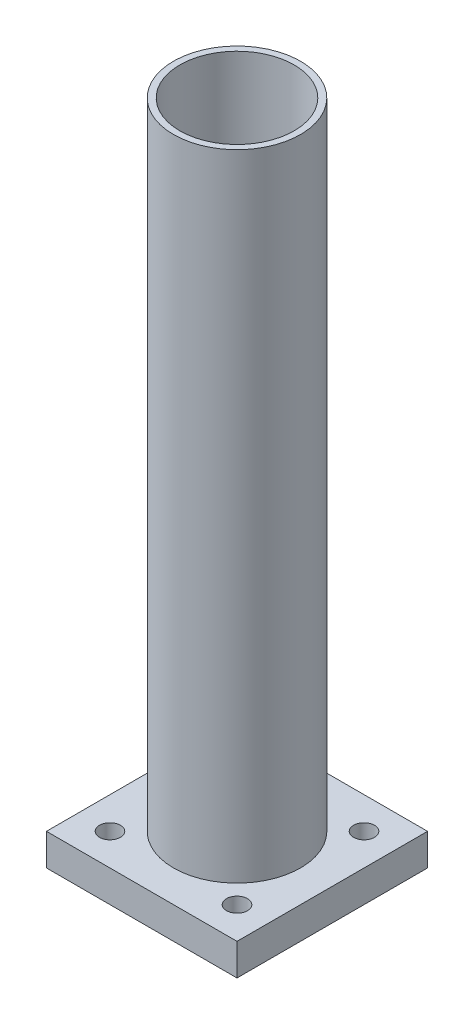
ISO-10303-21;
HEADER;
FILE_DESCRIPTION(('STEP AP214'),'2;1');
FILE_NAME('part.step','',(''),(''),'','','');
FILE_SCHEMA(('AUTOMOTIVE_DESIGN { 1 0 10303 214 1 1 1 1 }'));
ENDSEC;
DATA;
#1=APPLICATION_CONTEXT('core data for automotive mechanical design processes');
#2=APPLICATION_PROTOCOL_DEFINITION('international standard','automotive_design',2000,#1);
#3=PRODUCT_CONTEXT('',#1,'mechanical');
#4=PRODUCT('Part','Part','',(#3));
#5=PRODUCT_RELATED_PRODUCT_CATEGORY('part','',(#4));
#6=PRODUCT_DEFINITION_FORMATION('','',#4);
#7=PRODUCT_DEFINITION_CONTEXT('part definition',#1,'design');
#8=PRODUCT_DEFINITION('design','',#6,#7);
#9=PRODUCT_DEFINITION_SHAPE('','',#8);
#10=(LENGTH_UNIT() NAMED_UNIT(*) SI_UNIT(.MILLI.,.METRE.));
#11=(NAMED_UNIT(*) PLANE_ANGLE_UNIT() SI_UNIT($,.RADIAN.));
#12=(NAMED_UNIT(*) SI_UNIT($,.STERADIAN.) SOLID_ANGLE_UNIT());
#13=UNCERTAINTY_MEASURE_WITH_UNIT(LENGTH_MEASURE(1.E-05),#10,'distance_accuracy_value','');
#14=(GEOMETRIC_REPRESENTATION_CONTEXT(3) GLOBAL_UNCERTAINTY_ASSIGNED_CONTEXT((#13)) GLOBAL_UNIT_ASSIGNED_CONTEXT((#10,
#11,#12)) REPRESENTATION_CONTEXT('',''));
#15=CARTESIAN_POINT('',(0.,0.,0.));
#16=DIRECTION('',(0.,0.,1.));
#17=DIRECTION('',(1.,0.,0.));
#18=AXIS2_PLACEMENT_3D('',#15,#16,#17);
#19=CARTESIAN_POINT('',(-30.,-10.,30.));
#20=DIRECTION('',(-1.,0.,0.));
#21=DIRECTION('',(0.,0.,1.));
#22=AXIS2_PLACEMENT_3D('',#19,#20,#21);
#23=PLANE('',#22);
#24=DIRECTION('',(0.,0.,1.));
#25=VECTOR('',#24,1.);
#26=CARTESIAN_POINT('',(-30.,0.,30.));
#27=LINE('',#26,#25);
#28=CARTESIAN_POINT('',(-30.,0.,-30.));
#29=VERTEX_POINT('',#28);
#30=CARTESIAN_POINT('',(-30.,0.,30.));
#31=VERTEX_POINT('',#30);
#32=EDGE_CURVE('E108',#29,#31,#27,.T.);
#33=ORIENTED_EDGE('',*,*,#32,.F.);
#34=DIRECTION('',(0.,1.,0.));
#35=VECTOR('',#34,1.);
#36=CARTESIAN_POINT('',(-30.,-10.,-30.));
#37=LINE('',#36,#35);
#38=CARTESIAN_POINT('',(-30.,-10.,-30.));
#39=VERTEX_POINT('',#38);
#40=EDGE_CURVE('E12',#39,#29,#37,.T.);
#41=ORIENTED_EDGE('',*,*,#40,.F.);
#42=DIRECTION('',(0.,0.,1.));
#43=VECTOR('',#42,1.);
#44=CARTESIAN_POINT('',(-30.,-10.,30.));
#45=LINE('',#44,#43);
#46=CARTESIAN_POINT('',(-30.,-10.,30.));
#47=VERTEX_POINT('',#46);
#48=EDGE_CURVE('E101',#39,#47,#45,.T.);
#49=ORIENTED_EDGE('',*,*,#48,.T.);
#50=DIRECTION('',(0.,1.,0.));
#51=VECTOR('',#50,1.);
#52=CARTESIAN_POINT('',(-30.,-10.,30.));
#53=LINE('',#52,#51);
#54=EDGE_CURVE('E46',#47,#31,#53,.T.);
#55=ORIENTED_EDGE('',*,*,#54,.T.);
#56=EDGE_LOOP('',(#33,#41,#49,#55));
#57=FACE_BOUND('',#56,.T.);
#58=ADVANCED_FACE('F43',(#57),#23,.T.);
#59=CARTESIAN_POINT('',(30.,-10.,-30.));
#60=DIRECTION('',(0.,0.,-1.));
#61=DIRECTION('',(-1.,0.,0.));
#62=AXIS2_PLACEMENT_3D('',#59,#60,#61);
#63=PLANE('',#62);
#64=DIRECTION('',(-1.,0.,0.));
#65=VECTOR('',#64,1.);
#66=CARTESIAN_POINT('',(30.,0.,-30.));
#67=LINE('',#66,#65);
#68=CARTESIAN_POINT('',(30.,0.,-30.));
#69=VERTEX_POINT('',#68);
#70=EDGE_CURVE('E103',#69,#29,#67,.T.);
#71=ORIENTED_EDGE('',*,*,#70,.F.);
#72=DIRECTION('',(0.,1.,0.));
#73=VECTOR('',#72,1.);
#74=CARTESIAN_POINT('',(30.,-10.,-30.));
#75=LINE('',#74,#73);
#76=CARTESIAN_POINT('',(30.,-10.,-30.));
#77=VERTEX_POINT('',#76);
#78=EDGE_CURVE('E52',#77,#69,#75,.T.);
#79=ORIENTED_EDGE('',*,*,#78,.F.);
#80=DIRECTION('',(-1.,0.,0.));
#81=VECTOR('',#80,1.);
#82=CARTESIAN_POINT('',(30.,-10.,-30.));
#83=LINE('',#82,#81);
#84=EDGE_CURVE('E98',#77,#39,#83,.T.);
#85=ORIENTED_EDGE('',*,*,#84,.T.);
#86=ORIENTED_EDGE('',*,*,#40,.T.);
#87=EDGE_LOOP('',(#71,#79,#85,#86));
#88=FACE_BOUND('',#87,.T.);
#89=ADVANCED_FACE('F119',(#88),#63,.T.);
#90=CARTESIAN_POINT('',(30.,-10.,30.));
#91=DIRECTION('',(1.,0.,0.));
#92=DIRECTION('',(0.,0.,-1.));
#93=AXIS2_PLACEMENT_3D('',#90,#91,#92);
#94=PLANE('',#93);
#95=DIRECTION('',(0.,0.,-1.));
#96=VECTOR('',#95,1.);
#97=CARTESIAN_POINT('',(30.,0.,30.));
#98=LINE('',#97,#96);
#99=CARTESIAN_POINT('',(30.,0.,30.));
#100=VERTEX_POINT('',#99);
#101=EDGE_CURVE('E93',#100,#69,#98,.T.);
#102=ORIENTED_EDGE('',*,*,#101,.F.);
#103=DIRECTION('',(0.,1.,0.));
#104=VECTOR('',#103,1.);
#105=CARTESIAN_POINT('',(30.,-10.,30.));
#106=LINE('',#105,#104);
#107=CARTESIAN_POINT('',(30.,-10.,30.));
#108=VERTEX_POINT('',#107);
#109=EDGE_CURVE('E88',#108,#100,#106,.T.);
#110=ORIENTED_EDGE('',*,*,#109,.F.);
#111=DIRECTION('',(0.,0.,-1.));
#112=VECTOR('',#111,1.);
#113=CARTESIAN_POINT('',(30.,-10.,30.));
#114=LINE('',#113,#112);
#115=EDGE_CURVE('E91',#108,#77,#114,.T.);
#116=ORIENTED_EDGE('',*,*,#115,.T.);
#117=ORIENTED_EDGE('',*,*,#78,.T.);
#118=EDGE_LOOP('',(#102,#110,#116,#117));
#119=FACE_BOUND('',#118,.T.);
#120=ADVANCED_FACE('F90',(#119),#94,.T.);
#121=CARTESIAN_POINT('',(30.,-10.,30.));
#122=DIRECTION('',(0.,0.,1.));
#123=DIRECTION('',(1.,0.,0.));
#124=AXIS2_PLACEMENT_3D('',#121,#122,#123);
#125=PLANE('',#124);
#126=DIRECTION('',(1.,0.,0.));
#127=VECTOR('',#126,1.);
#128=CARTESIAN_POINT('',(30.,0.,30.));
#129=LINE('',#128,#127);
#130=EDGE_CURVE('E111',#31,#100,#129,.T.);
#131=ORIENTED_EDGE('',*,*,#130,.F.);
#132=ORIENTED_EDGE('',*,*,#54,.F.);
#133=DIRECTION('',(1.,0.,0.));
#134=VECTOR('',#133,1.);
#135=CARTESIAN_POINT('',(30.,-10.,30.));
#136=LINE('',#135,#134);
#137=EDGE_CURVE('E97',#47,#108,#136,.T.);
#138=ORIENTED_EDGE('',*,*,#137,.T.);
#139=ORIENTED_EDGE('',*,*,#109,.T.);
#140=EDGE_LOOP('',(#131,#132,#138,#139));
#141=FACE_BOUND('',#140,.T.);
#142=ADVANCED_FACE('F100',(#141),#125,.T.);
#143=CARTESIAN_POINT('',(0.,-10.,0.));
#144=DIRECTION('',(0.,1.,0.));
#145=DIRECTION('',(0.,0.,1.));
#146=AXIS2_PLACEMENT_3D('',#143,#144,#145);
#147=PLANE('',#146);
#148=CARTESIAN_POINT('',(20.,-9.99999999999999,-20.));
#149=DIRECTION('',(0.,1.,0.));
#150=DIRECTION('',(0.,0.,1.));
#151=AXIS2_PLACEMENT_3D('',#148,#149,#150);
#152=CIRCLE('',#151,3.29999999999999);
#153=CARTESIAN_POINT('',(20.,-9.99999999999999,-16.7));
#154=VERTEX_POINT('',#153);
#155=EDGE_CURVE('E160',#154,#154,#152,.T.);
#156=ORIENTED_EDGE('',*,*,#155,.T.);
#157=EDGE_LOOP('',(#156));
#158=FACE_BOUND('',#157,.T.);
#159=CARTESIAN_POINT('',(-20.,-9.99999999999999,-20.));
#160=DIRECTION('',(0.,1.,0.));
#161=DIRECTION('',(0.,0.,1.));
#162=AXIS2_PLACEMENT_3D('',#159,#160,#161);
#163=CIRCLE('',#162,3.29999999999999);
#164=CARTESIAN_POINT('',(-20.,-9.99999999999999,-16.7));
#165=VERTEX_POINT('',#164);
#166=EDGE_CURVE('E170',#165,#165,#163,.T.);
#167=ORIENTED_EDGE('',*,*,#166,.T.);
#168=EDGE_LOOP('',(#167));
#169=FACE_BOUND('',#168,.T.);
#170=CARTESIAN_POINT('',(-20.,-9.99999999999999,20.));
#171=DIRECTION('',(0.,1.,0.));
#172=DIRECTION('',(0.,0.,1.));
#173=AXIS2_PLACEMENT_3D('',#170,#171,#172);
#174=CIRCLE('',#173,3.29999999999999);
#175=CARTESIAN_POINT('',(-20.,-9.99999999999999,23.3));
#176=VERTEX_POINT('',#175);
#177=EDGE_CURVE('E176',#176,#176,#174,.T.);
#178=ORIENTED_EDGE('',*,*,#177,.T.);
#179=EDGE_LOOP('',(#178));
#180=FACE_BOUND('',#179,.T.);
#181=CARTESIAN_POINT('',(20.,-9.99999999999999,20.));
#182=DIRECTION('',(0.,1.,0.));
#183=DIRECTION('',(0.,0.,1.));
#184=AXIS2_PLACEMENT_3D('',#181,#182,#183);
#185=CIRCLE('',#184,3.29999999999999);
#186=CARTESIAN_POINT('',(20.,-9.99999999999999,23.3));
#187=VERTEX_POINT('',#186);
#188=EDGE_CURVE('E112',#187,#187,#185,.T.);
#189=ORIENTED_EDGE('',*,*,#188,.T.);
#190=EDGE_LOOP('',(#189));
#191=FACE_BOUND('',#190,.T.);
#192=ORIENTED_EDGE('',*,*,#48,.F.);
#193=ORIENTED_EDGE('',*,*,#84,.F.);
#194=ORIENTED_EDGE('',*,*,#115,.F.);
#195=ORIENTED_EDGE('',*,*,#137,.F.);
#196=EDGE_LOOP('',(#192,#193,#194,#195));
#197=FACE_BOUND('',#196,.T.);
#198=ADVANCED_FACE('F96',(#158,#169,#180,#191,#197),#147,.F.);
#199=CARTESIAN_POINT('',(0.,0.,0.));
#200=DIRECTION('',(0.,1.,0.));
#201=DIRECTION('',(0.,0.,1.));
#202=AXIS2_PLACEMENT_3D('',#199,#200,#201);
#203=PLANE('',#202);
#204=CARTESIAN_POINT('',(20.,0.,-20.));
#205=DIRECTION('',(0.,1.,0.));
#206=DIRECTION('',(0.,0.,1.));
#207=AXIS2_PLACEMENT_3D('',#204,#205,#206);
#208=CIRCLE('',#207,3.29999999999999);
#209=CARTESIAN_POINT('',(20.,0.,-16.7));
#210=VERTEX_POINT('',#209);
#211=EDGE_CURVE('E163',#210,#210,#208,.T.);
#212=ORIENTED_EDGE('',*,*,#211,.F.);
#213=EDGE_LOOP('',(#212));
#214=FACE_BOUND('',#213,.T.);
#215=CARTESIAN_POINT('',(-20.,0.,-20.));
#216=DIRECTION('',(0.,1.,0.));
#217=DIRECTION('',(0.,0.,1.));
#218=AXIS2_PLACEMENT_3D('',#215,#216,#217);
#219=CIRCLE('',#218,3.29999999999999);
#220=CARTESIAN_POINT('',(-20.,0.,-16.7));
#221=VERTEX_POINT('',#220);
#222=EDGE_CURVE('E165',#221,#221,#219,.T.);
#223=ORIENTED_EDGE('',*,*,#222,.F.);
#224=EDGE_LOOP('',(#223));
#225=FACE_BOUND('',#224,.T.);
#226=CARTESIAN_POINT('',(-20.,0.,20.));
#227=DIRECTION('',(0.,1.,0.));
#228=DIRECTION('',(0.,0.,1.));
#229=AXIS2_PLACEMENT_3D('',#226,#227,#228);
#230=CIRCLE('',#229,3.29999999999999);
#231=CARTESIAN_POINT('',(-20.,0.,23.3));
#232=VERTEX_POINT('',#231);
#233=EDGE_CURVE('E173',#232,#232,#230,.T.);
#234=ORIENTED_EDGE('',*,*,#233,.F.);
#235=EDGE_LOOP('',(#234));
#236=FACE_BOUND('',#235,.T.);
#237=CARTESIAN_POINT('',(20.,0.,20.));
#238=DIRECTION('',(0.,1.,0.));
#239=DIRECTION('',(0.,0.,1.));
#240=AXIS2_PLACEMENT_3D('',#237,#238,#239);
#241=CIRCLE('',#240,3.29999999999999);
#242=CARTESIAN_POINT('',(20.,0.,23.3));
#243=VERTEX_POINT('',#242);
#244=EDGE_CURVE('E179',#243,#243,#241,.T.);
#245=ORIENTED_EDGE('',*,*,#244,.F.);
#246=EDGE_LOOP('',(#245));
#247=FACE_BOUND('',#246,.T.);
#248=ORIENTED_EDGE('',*,*,#32,.T.);
#249=ORIENTED_EDGE('',*,*,#130,.T.);
#250=ORIENTED_EDGE('',*,*,#101,.T.);
#251=ORIENTED_EDGE('',*,*,#70,.T.);
#252=EDGE_LOOP('',(#248,#249,#250,#251));
#253=FACE_BOUND('',#252,.T.);
#254=ADVANCED_FACE('F118',(#214,#225,#236,#247,#253),#203,.T.);
#255=CARTESIAN_POINT('',(20.,0.,20.));
#256=DIRECTION('',(0.,1.,0.));
#257=DIRECTION('',(0.,0.,1.));
#258=AXIS2_PLACEMENT_3D('',#255,#256,#257);
#259=CYLINDRICAL_SURFACE('',#258,3.29999999999999);
#260=ORIENTED_EDGE('',*,*,#188,.F.);
#261=EDGE_LOOP('',(#260));
#262=FACE_BOUND('',#261,.T.);
#263=ORIENTED_EDGE('',*,*,#244,.T.);
#264=EDGE_LOOP('',(#263));
#265=FACE_BOUND('',#264,.T.);
#266=ADVANCED_FACE('F137',(#262,#265),#259,.F.);
#267=CARTESIAN_POINT('',(-20.,0.,20.));
#268=DIRECTION('',(0.,1.,0.));
#269=DIRECTION('',(0.,0.,1.));
#270=AXIS2_PLACEMENT_3D('',#267,#268,#269);
#271=CYLINDRICAL_SURFACE('',#270,3.29999999999999);
#272=ORIENTED_EDGE('',*,*,#177,.F.);
#273=EDGE_LOOP('',(#272));
#274=FACE_BOUND('',#273,.T.);
#275=ORIENTED_EDGE('',*,*,#233,.T.);
#276=EDGE_LOOP('',(#275));
#277=FACE_BOUND('',#276,.T.);
#278=ADVANCED_FACE('F144',(#274,#277),#271,.F.);
#279=CARTESIAN_POINT('',(-20.,0.,-20.));
#280=DIRECTION('',(0.,1.,0.));
#281=DIRECTION('',(0.,0.,1.));
#282=AXIS2_PLACEMENT_3D('',#279,#280,#281);
#283=CYLINDRICAL_SURFACE('',#282,3.29999999999999);
#284=ORIENTED_EDGE('',*,*,#166,.F.);
#285=EDGE_LOOP('',(#284));
#286=FACE_BOUND('',#285,.T.);
#287=ORIENTED_EDGE('',*,*,#222,.T.);
#288=EDGE_LOOP('',(#287));
#289=FACE_BOUND('',#288,.T.);
#290=ADVANCED_FACE('F148',(#286,#289),#283,.F.);
#291=CARTESIAN_POINT('',(20.,0.,-20.));
#292=DIRECTION('',(0.,1.,0.));
#293=DIRECTION('',(0.,0.,1.));
#294=AXIS2_PLACEMENT_3D('',#291,#292,#293);
#295=CYLINDRICAL_SURFACE('',#294,3.29999999999999);
#296=ORIENTED_EDGE('',*,*,#155,.F.);
#297=EDGE_LOOP('',(#296));
#298=FACE_BOUND('',#297,.T.);
#299=ORIENTED_EDGE('',*,*,#211,.T.);
#300=EDGE_LOOP('',(#299));
#301=FACE_BOUND('',#300,.T.);
#302=ADVANCED_FACE('F152',(#298,#301),#295,.F.);
#303=CLOSED_SHELL('',(#58,#89,#120,#142,#198,#254,#266,#278,#290,#302));
#304=MANIFOLD_SOLID_BREP('B2',#303);
#305=CARTESIAN_POINT('',(0.,200.,0.));
#306=DIRECTION('',(0.,1.,0.));
#307=DIRECTION('',(0.,0.,1.));
#308=AXIS2_PLACEMENT_3D('',#305,#306,#307);
#309=PLANE('',#308);
#310=CARTESIAN_POINT('',(0.,200.,0.));
#311=DIRECTION('',(0.,1.,0.));
#312=DIRECTION('',(0.,0.,1.));
#313=AXIS2_PLACEMENT_3D('',#310,#311,#312);
#314=CIRCLE('',#313,20.);
#315=CARTESIAN_POINT('',(0.,200.,20.));
#316=VERTEX_POINT('',#315);
#317=EDGE_CURVE('E42',#316,#316,#314,.T.);
#318=ORIENTED_EDGE('',*,*,#317,.T.);
#319=EDGE_LOOP('',(#318));
#320=FACE_BOUND('',#319,.T.);
#321=CARTESIAN_POINT('',(0.,200.,0.));
#322=DIRECTION('',(0.,1.,0.));
#323=DIRECTION('',(0.,0.,1.));
#324=AXIS2_PLACEMENT_3D('',#321,#322,#323);
#325=CIRCLE('',#324,18.);
#326=CARTESIAN_POINT('',(0.,200.,18.));
#327=VERTEX_POINT('',#326);
#328=EDGE_CURVE('E262',#327,#327,#325,.T.);
#329=ORIENTED_EDGE('',*,*,#328,.F.);
#330=EDGE_LOOP('',(#329));
#331=FACE_BOUND('',#330,.T.);
#332=ADVANCED_FACE('F251',(#320,#331),#309,.T.);
#333=CARTESIAN_POINT('',(0.,0.,0.));
#334=DIRECTION('',(0.,1.,0.));
#335=DIRECTION('',(0.,0.,1.));
#336=AXIS2_PLACEMENT_3D('',#333,#334,#335);
#337=PLANE('',#336);
#338=CARTESIAN_POINT('',(0.,0.,0.));
#339=DIRECTION('',(0.,1.,0.));
#340=DIRECTION('',(0.,0.,1.));
#341=AXIS2_PLACEMENT_3D('',#338,#339,#340);
#342=CIRCLE('',#341,20.);
#343=CARTESIAN_POINT('',(0.,0.,20.));
#344=VERTEX_POINT('',#343);
#345=EDGE_CURVE('E255',#344,#344,#342,.T.);
#346=ORIENTED_EDGE('',*,*,#345,.F.);
#347=EDGE_LOOP('',(#346));
#348=FACE_BOUND('',#347,.T.);
#349=CARTESIAN_POINT('',(0.,0.,0.));
#350=DIRECTION('',(0.,1.,0.));
#351=DIRECTION('',(0.,0.,1.));
#352=AXIS2_PLACEMENT_3D('',#349,#350,#351);
#353=CIRCLE('',#352,18.);
#354=CARTESIAN_POINT('',(0.,0.,18.));
#355=VERTEX_POINT('',#354);
#356=EDGE_CURVE('E264',#355,#355,#353,.T.);
#357=ORIENTED_EDGE('',*,*,#356,.T.);
#358=EDGE_LOOP('',(#357));
#359=FACE_BOUND('',#358,.T.);
#360=ADVANCED_FACE('F274',(#348,#359),#337,.F.);
#361=CARTESIAN_POINT('',(0.,200.,0.));
#362=DIRECTION('',(0.,-1.,0.));
#363=DIRECTION('',(0.,0.,-1.));
#364=AXIS2_PLACEMENT_3D('',#361,#362,#363);
#365=CYLINDRICAL_SURFACE('',#364,20.);
#366=ORIENTED_EDGE('',*,*,#317,.F.);
#367=EDGE_LOOP('',(#366));
#368=FACE_BOUND('',#367,.T.);
#369=ORIENTED_EDGE('',*,*,#345,.T.);
#370=EDGE_LOOP('',(#369));
#371=FACE_BOUND('',#370,.T.);
#372=ADVANCED_FACE('F253',(#368,#371),#365,.T.);
#373=CARTESIAN_POINT('',(0.,200.,0.));
#374=DIRECTION('',(0.,-1.,0.));
#375=DIRECTION('',(0.,0.,-1.));
#376=AXIS2_PLACEMENT_3D('',#373,#374,#375);
#377=CYLINDRICAL_SURFACE('',#376,18.);
#378=ORIENTED_EDGE('',*,*,#328,.T.);
#379=EDGE_LOOP('',(#378));
#380=FACE_BOUND('',#379,.T.);
#381=ORIENTED_EDGE('',*,*,#356,.F.);
#382=EDGE_LOOP('',(#381));
#383=FACE_BOUND('',#382,.T.);
#384=ADVANCED_FACE('F270',(#380,#383),#377,.F.);
#385=CLOSED_SHELL('',(#332,#360,#372,#384));
#386=MANIFOLD_SOLID_BREP('B6',#385);
#387=ADVANCED_BREP_SHAPE_REPRESENTATION('',(#18,#304,#386),#14);
#388=SHAPE_DEFINITION_REPRESENTATION(#9,#387);
ENDSEC;
END-ISO-10303-21;
